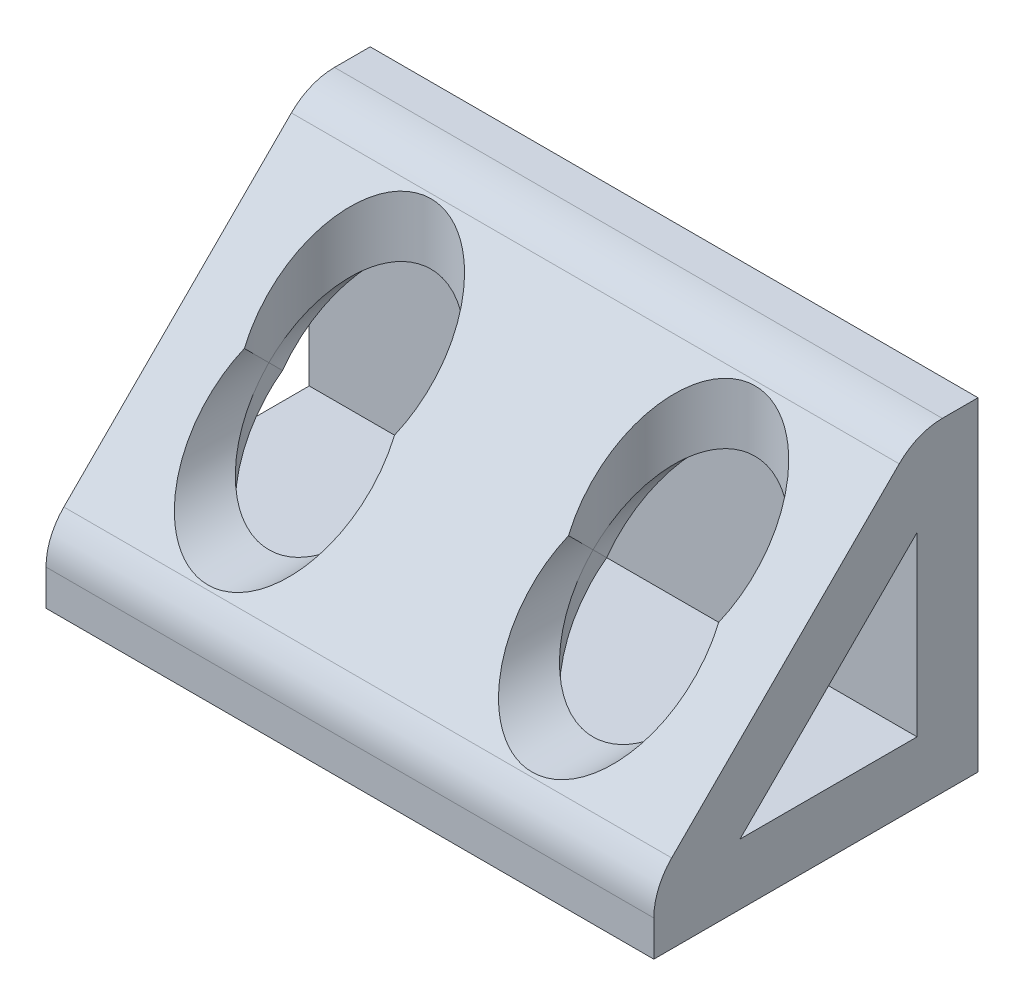
ISO-10303-21;
HEADER;
FILE_DESCRIPTION(('STEP AP214'),'2;1');
FILE_NAME('part.step','',(''),(''),'','','');
FILE_SCHEMA(('AUTOMOTIVE_DESIGN { 1 0 10303 214 1 1 1 1 }'));
ENDSEC;
DATA;
#1=APPLICATION_CONTEXT('core data for automotive mechanical design processes');
#2=APPLICATION_PROTOCOL_DEFINITION('international standard','automotive_design',2000,#1);
#3=PRODUCT_CONTEXT('',#1,'mechanical');
#4=PRODUCT('Part','Part','',(#3));
#5=PRODUCT_RELATED_PRODUCT_CATEGORY('part','',(#4));
#6=PRODUCT_DEFINITION_FORMATION('','',#4);
#7=PRODUCT_DEFINITION_CONTEXT('part definition',#1,'design');
#8=PRODUCT_DEFINITION('design','',#6,#7);
#9=PRODUCT_DEFINITION_SHAPE('','',#8);
#10=(LENGTH_UNIT() NAMED_UNIT(*) SI_UNIT(.MILLI.,.METRE.));
#11=(NAMED_UNIT(*) PLANE_ANGLE_UNIT() SI_UNIT($,.RADIAN.));
#12=(NAMED_UNIT(*) SI_UNIT($,.STERADIAN.) SOLID_ANGLE_UNIT());
#13=UNCERTAINTY_MEASURE_WITH_UNIT(LENGTH_MEASURE(1.E-05),#10,'distance_accuracy_value','');
#14=(GEOMETRIC_REPRESENTATION_CONTEXT(3) GLOBAL_UNCERTAINTY_ASSIGNED_CONTEXT((#13)) GLOBAL_UNIT_ASSIGNED_CONTEXT((#10,
#11,#12)) REPRESENTATION_CONTEXT('',''));
#15=CARTESIAN_POINT('',(0.,0.,0.));
#16=DIRECTION('',(0.,0.,1.));
#17=DIRECTION('',(1.,0.,0.));
#18=AXIS2_PLACEMENT_3D('',#15,#16,#17);
#19=CARTESIAN_POINT('',(-12.7,4.7752,12.7));
#20=DIRECTION('',(0.,-1.,0.));
#21=DIRECTION('',(0.,0.,-1.));
#22=AXIS2_PLACEMENT_3D('',#19,#20,#21);
#23=CYLINDRICAL_SURFACE('',#22,6.35);
#24=CARTESIAN_POINT('',(-12.7,10.722047396956,12.7));
#25=DIRECTION('',(0.,-0.707106781186548,-0.707106781186548));
#26=DIRECTION('',(0.,0.707106781186548,-0.707106781186548));
#27=AXIS2_PLACEMENT_3D('',#24,#25,#26);
#28=ELLIPSE('',#27,8.98025612106916,6.35);
#29=CARTESIAN_POINT('',(-14.9265457635804,4.7752,18.646847396956));
#30=VERTEX_POINT('',#29);
#31=CARTESIAN_POINT('',(-18.9725135213109,11.711023698478,11.711023698478));
#32=VERTEX_POINT('',#31);
#33=EDGE_CURVE('E541',#30,#32,#28,.T.);
#34=ORIENTED_EDGE('',*,*,#33,.T.);
#35=CARTESIAN_POINT('',(-12.7,12.7,12.7));
#36=DIRECTION('',(0.,0.707106781186548,-0.707106781186548));
#37=DIRECTION('',(0.,0.707106781186548,0.707106781186548));
#38=AXIS2_PLACEMENT_3D('',#35,#36,#37);
#39=ELLIPSE('',#38,8.98025612106916,6.35);
#40=CARTESIAN_POINT('',(-19.05,12.7,12.7));
#41=VERTEX_POINT('',#40);
#42=EDGE_CURVE('E543',#32,#41,#39,.T.);
#43=ORIENTED_EDGE('',*,*,#42,.T.);
#44=CARTESIAN_POINT('',(-12.7,12.7,12.7));
#45=DIRECTION('',(0.,0.707106781186548,0.707106781186548));
#46=DIRECTION('',(0.,0.707106781186548,-0.707106781186548));
#47=AXIS2_PLACEMENT_3D('',#44,#45,#46);
#48=ELLIPSE('',#47,8.98025612106916,6.35);
#49=CARTESIAN_POINT('',(-6.35,12.7,12.7));
#50=VERTEX_POINT('',#49);
#51=EDGE_CURVE('E552',#41,#50,#48,.T.);
#52=ORIENTED_EDGE('',*,*,#51,.T.);
#53=CARTESIAN_POINT('',(-12.7,12.7,12.7));
#54=DIRECTION('',(0.,0.707106781186548,-0.707106781186548));
#55=DIRECTION('',(0.,0.707106781186548,0.707106781186548));
#56=AXIS2_PLACEMENT_3D('',#53,#54,#55);
#57=ELLIPSE('',#56,8.98025612106916,6.35);
#58=CARTESIAN_POINT('',(-6.42748647868912,11.711023698478,11.711023698478));
#59=VERTEX_POINT('',#58);
#60=EDGE_CURVE('E833',#50,#59,#57,.T.);
#61=ORIENTED_EDGE('',*,*,#60,.T.);
#62=CARTESIAN_POINT('',(-12.7,10.722047396956,12.7));
#63=DIRECTION('',(0.,-0.707106781186548,-0.707106781186548));
#64=DIRECTION('',(0.,0.707106781186548,-0.707106781186548));
#65=AXIS2_PLACEMENT_3D('',#62,#63,#64);
#66=ELLIPSE('',#65,8.98025612106916,6.35);
#67=CARTESIAN_POINT('',(-10.4734542364196,4.7752,18.646847396956));
#68=VERTEX_POINT('',#67);
#69=EDGE_CURVE('E353',#59,#68,#66,.T.);
#70=ORIENTED_EDGE('',*,*,#69,.T.);
#71=CARTESIAN_POINT('',(-12.7,4.7752,12.7));
#72=DIRECTION('',(0.,1.,0.));
#73=DIRECTION('',(1.,0.,0.));
#74=AXIS2_PLACEMENT_3D('',#71,#72,#73);
#75=CIRCLE('',#74,6.35);
#76=EDGE_CURVE('E343',#30,#68,#75,.T.);
#77=ORIENTED_EDGE('',*,*,#76,.F.);
#78=EDGE_LOOP('',(#34,#43,#52,#61,#70,#77));
#79=FACE_BOUND('',#78,.T.);
#80=ADVANCED_FACE('F41',(#79),#23,.F.);
#81=CARTESIAN_POINT('',(23.8125,24.001376301522,6.173823698478));
#82=DIRECTION('',(0.,-0.707106781186548,-0.707106781186548));
#83=DIRECTION('',(0.,0.707106781186548,-0.707106781186548));
#84=AXIS2_PLACEMENT_3D('',#81,#82,#83);
#85=PLANE('',#84);
#86=CARTESIAN_POINT('',(-12.7,17.4752,12.7));
#87=DIRECTION('',(0.,-0.707106781186548,-0.707106781186548));
#88=DIRECTION('',(0.,0.707106781186548,-0.707106781186548));
#89=AXIS2_PLACEMENT_3D('',#86,#87,#88);
#90=ELLIPSE('',#89,8.98025612106916,6.35);
#91=CARTESIAN_POINT('',(-18.5840348605357,15.0876,15.0876));
#92=VERTEX_POINT('',#91);
#93=CARTESIAN_POINT('',(-6.81596513946425,15.0876,15.0876));
#94=VERTEX_POINT('',#93);
#95=EDGE_CURVE('E326',#92,#94,#90,.T.);
#96=ORIENTED_EDGE('',*,*,#95,.T.);
#97=CARTESIAN_POINT('',(-12.7,12.7,17.4752));
#98=DIRECTION('',(0.,-0.707106781186548,-0.707106781186548));
#99=DIRECTION('',(0.,-0.707106781186548,0.707106781186548));
#100=AXIS2_PLACEMENT_3D('',#97,#98,#99);
#101=ELLIPSE('',#100,8.98025612106916,6.35);
#102=EDGE_CURVE('E869',#94,#92,#101,.T.);
#103=ORIENTED_EDGE('',*,*,#102,.T.);
#104=EDGE_LOOP('',(#96,#103));
#105=FACE_BOUND('',#104,.T.);
#106=CARTESIAN_POINT('',(12.7,12.7,17.4752));
#107=DIRECTION('',(0.,-0.707106781186548,-0.707106781186548));
#108=DIRECTION('',(0.,-0.707106781186548,0.707106781186548));
#109=AXIS2_PLACEMENT_3D('',#106,#107,#108);
#110=ELLIPSE('',#109,8.98025612106916,6.35);
#111=CARTESIAN_POINT('',(18.5840348605357,15.0876,15.0876));
#112=VERTEX_POINT('',#111);
#113=CARTESIAN_POINT('',(6.81596513946425,15.0876,15.0876));
#114=VERTEX_POINT('',#113);
#115=EDGE_CURVE('E874',#112,#114,#110,.T.);
#116=ORIENTED_EDGE('',*,*,#115,.T.);
#117=CARTESIAN_POINT('',(12.7,17.4752,12.7));
#118=DIRECTION('',(0.,-0.707106781186548,-0.707106781186548));
#119=DIRECTION('',(0.,0.707106781186548,-0.707106781186548));
#120=AXIS2_PLACEMENT_3D('',#117,#118,#119);
#121=ELLIPSE('',#120,8.98025612106916,6.35);
#122=EDGE_CURVE('E218',#114,#112,#121,.T.);
#123=ORIENTED_EDGE('',*,*,#122,.T.);
#124=EDGE_LOOP('',(#116,#123));
#125=FACE_BOUND('',#124,.T.);
#126=DIRECTION('',(0.,-0.707106781186548,0.707106781186548));
#127=VECTOR('',#126,1.);
#128=CARTESIAN_POINT('',(23.8125,24.001376301522,6.173823698478));
#129=LINE('',#128,#127);
#130=CARTESIAN_POINT('',(23.8125,24.0013763015224,6.17382369847762));
#131=VERTEX_POINT('',#130);
#132=CARTESIAN_POINT('',(23.8125,6.17382369847761,24.0013763015224));
#133=VERTEX_POINT('',#132);
#134=EDGE_CURVE('E219',#131,#133,#129,.T.);
#135=ORIENTED_EDGE('',*,*,#134,.F.);
#136=DIRECTION('',(-1.,0.,0.));
#137=VECTOR('',#136,1.);
#138=CARTESIAN_POINT('',(23.8125,24.0013763015224,6.17382369847762));
#139=LINE('',#138,#137);
#140=CARTESIAN_POINT('',(-23.8125,24.0013763015224,6.17382369847762));
#141=VERTEX_POINT('',#140);
#142=EDGE_CURVE('E535',#131,#141,#139,.T.);
#143=ORIENTED_EDGE('',*,*,#142,.T.);
#144=DIRECTION('',(0.,-0.707106781186548,0.707106781186548));
#145=VECTOR('',#144,1.);
#146=CARTESIAN_POINT('',(-23.8125,24.001376301522,6.173823698478));
#147=LINE('',#146,#145);
#148=CARTESIAN_POINT('',(-23.8125,6.17382369847761,24.0013763015224));
#149=VERTEX_POINT('',#148);
#150=EDGE_CURVE('E213',#141,#149,#147,.T.);
#151=ORIENTED_EDGE('',*,*,#150,.T.);
#152=DIRECTION('',(-1.,0.,0.));
#153=VECTOR('',#152,1.);
#154=CARTESIAN_POINT('',(23.8125,6.17382369847762,24.0013763015224));
#155=LINE('',#154,#153);
#156=EDGE_CURVE('E537',#149,#133,#155,.F.);
#157=ORIENTED_EDGE('',*,*,#156,.T.);
#158=EDGE_LOOP('',(#135,#143,#151,#157));
#159=FACE_BOUND('',#158,.T.);
#160=ADVANCED_FACE('F534',(#105,#125,#159),#85,.F.);
#161=CARTESIAN_POINT('',(23.8125,2.79724739695653,20.6248000000013));
#162=DIRECTION('',(1.,0.,0.));
#163=DIRECTION('',(0.,0.,-1.));
#164=AXIS2_PLACEMENT_3D('',#161,#162,#163);
#165=PLANE('',#164);
#166=DIRECTION('',(0.,0.,1.));
#167=VECTOR('',#166,1.);
#168=CARTESIAN_POINT('',(23.8125,25.4,0.));
#169=LINE('',#168,#167);
#170=CARTESIAN_POINT('',(23.8125,25.4,0.));
#171=VERTEX_POINT('',#170);
#172=CARTESIAN_POINT('',(23.8125,25.4,2.79724739695653));
#173=VERTEX_POINT('',#172);
#174=EDGE_CURVE('E184',#171,#173,#169,.T.);
#175=ORIENTED_EDGE('',*,*,#174,.T.);
#176=CARTESIAN_POINT('',(23.8125,20.6248000000013,2.79724739695653));
#177=DIRECTION('',(1.,0.,0.));
#178=DIRECTION('',(0.,0.,-1.));
#179=AXIS2_PLACEMENT_3D('',#176,#177,#178);
#180=CIRCLE('',#179,4.7751999999987);
#181=EDGE_CURVE('E49',#173,#131,#180,.T.);
#182=ORIENTED_EDGE('',*,*,#181,.T.);
#183=ORIENTED_EDGE('',*,*,#134,.T.);
#184=CARTESIAN_POINT('',(23.8125,2.79724739695653,20.6248000000013));
#185=DIRECTION('',(1.,0.,0.));
#186=DIRECTION('',(0.,0.,-1.));
#187=AXIS2_PLACEMENT_3D('',#184,#185,#186);
#188=CIRCLE('',#187,4.7751999999987);
#189=CARTESIAN_POINT('',(23.8125,2.79724739695653,25.4));
#190=VERTEX_POINT('',#189);
#191=EDGE_CURVE('E56',#133,#190,#188,.T.);
#192=ORIENTED_EDGE('',*,*,#191,.T.);
#193=DIRECTION('',(0.,1.,0.));
#194=VECTOR('',#193,1.);
#195=CARTESIAN_POINT('',(23.8125,0.,25.4));
#196=LINE('',#195,#194);
#197=CARTESIAN_POINT('',(23.8125,0.,25.4));
#198=VERTEX_POINT('',#197);
#199=EDGE_CURVE('E492',#198,#190,#196,.T.);
#200=ORIENTED_EDGE('',*,*,#199,.F.);
#201=DIRECTION('',(0.,0.,1.));
#202=VECTOR('',#201,1.);
#203=CARTESIAN_POINT('',(23.8125,0.,25.4));
#204=LINE('',#203,#202);
#205=CARTESIAN_POINT('',(23.8125,0.,0.));
#206=VERTEX_POINT('',#205);
#207=EDGE_CURVE('E186',#206,#198,#204,.T.);
#208=ORIENTED_EDGE('',*,*,#207,.F.);
#209=DIRECTION('',(0.,-1.,0.));
#210=VECTOR('',#209,1.);
#211=CARTESIAN_POINT('',(23.8125,0.,0.));
#212=LINE('',#211,#210);
#213=EDGE_CURVE('E180',#171,#206,#212,.T.);
#214=ORIENTED_EDGE('',*,*,#213,.F.);
#215=EDGE_LOOP('',(#175,#182,#183,#192,#200,#208,#214));
#216=FACE_BOUND('',#215,.T.);
#217=DIRECTION('',(0.,-0.707106781186548,0.707106781186548));
#218=VECTOR('',#217,1.);
#219=CARTESIAN_POINT('',(23.8125,18.646847396956,4.7752));
#220=LINE('',#219,#218);
#221=CARTESIAN_POINT('',(23.8125,18.646847396956,4.7752));
#222=VERTEX_POINT('',#221);
#223=CARTESIAN_POINT('',(23.8125,4.7752,18.646847396956));
#224=VERTEX_POINT('',#223);
#225=EDGE_CURVE('E539',#222,#224,#220,.T.);
#226=ORIENTED_EDGE('',*,*,#225,.F.);
#227=DIRECTION('',(0.,-1.,0.));
#228=VECTOR('',#227,1.);
#229=CARTESIAN_POINT('',(23.8125,0.,4.7752));
#230=LINE('',#229,#228);
#231=CARTESIAN_POINT('',(23.8125,4.7752,4.7752));
#232=VERTEX_POINT('',#231);
#233=EDGE_CURVE('E507',#222,#232,#230,.T.);
#234=ORIENTED_EDGE('',*,*,#233,.T.);
#235=DIRECTION('',(0.,0.,1.));
#236=VECTOR('',#235,1.);
#237=CARTESIAN_POINT('',(23.8125,4.7752,25.4));
#238=LINE('',#237,#236);
#239=EDGE_CURVE('E205',#232,#224,#238,.T.);
#240=ORIENTED_EDGE('',*,*,#239,.T.);
#241=EDGE_LOOP('',(#226,#234,#240));
#242=FACE_BOUND('',#241,.T.);
#243=ADVANCED_FACE('F182',(#216,#242),#165,.T.);
#244=CARTESIAN_POINT('',(12.7,12.7,4.7752));
#245=DIRECTION('',(0.,0.,-1.));
#246=DIRECTION('',(0.,-1.,0.));
#247=AXIS2_PLACEMENT_3D('',#244,#245,#246);
#248=CYLINDRICAL_SURFACE('',#247,6.35);
#249=CARTESIAN_POINT('',(12.7,12.7,10.722047396956));
#250=DIRECTION('',(0.,-0.707106781186548,-0.707106781186548));
#251=DIRECTION('',(0.,-0.707106781186548,0.707106781186548));
#252=AXIS2_PLACEMENT_3D('',#249,#250,#251);
#253=ELLIPSE('',#252,8.98025612106916,6.35);
#254=CARTESIAN_POINT('',(14.9265457635804,18.646847396956,4.7752));
#255=VERTEX_POINT('',#254);
#256=CARTESIAN_POINT('',(18.9725135213109,11.711023698478,11.711023698478));
#257=VERTEX_POINT('',#256);
#258=EDGE_CURVE('E380',#255,#257,#253,.T.);
#259=ORIENTED_EDGE('',*,*,#258,.T.);
#260=CARTESIAN_POINT('',(12.7,12.7,12.7));
#261=DIRECTION('',(0.,-0.707106781186548,0.707106781186548));
#262=DIRECTION('',(0.,0.707106781186548,0.707106781186548));
#263=AXIS2_PLACEMENT_3D('',#260,#261,#262);
#264=ELLIPSE('',#263,8.98025612106916,6.35);
#265=CARTESIAN_POINT('',(19.05,12.7,12.7));
#266=VERTEX_POINT('',#265);
#267=EDGE_CURVE('E392',#257,#266,#264,.T.);
#268=ORIENTED_EDGE('',*,*,#267,.T.);
#269=CARTESIAN_POINT('',(12.7,12.7,12.7));
#270=DIRECTION('',(0.,0.707106781186548,0.707106781186548));
#271=DIRECTION('',(0.,-0.707106781186548,0.707106781186548));
#272=AXIS2_PLACEMENT_3D('',#269,#270,#271);
#273=ELLIPSE('',#272,8.98025612106916,6.35);
#274=CARTESIAN_POINT('',(6.35,12.7,12.7));
#275=VERTEX_POINT('',#274);
#276=EDGE_CURVE('E395',#266,#275,#273,.T.);
#277=ORIENTED_EDGE('',*,*,#276,.T.);
#278=CARTESIAN_POINT('',(12.7,12.7,12.7));
#279=DIRECTION('',(0.,-0.707106781186548,0.707106781186548));
#280=DIRECTION('',(0.,0.707106781186548,0.707106781186548));
#281=AXIS2_PLACEMENT_3D('',#278,#279,#280);
#282=ELLIPSE('',#281,8.98025612106916,6.35);
#283=CARTESIAN_POINT('',(6.42748647868912,11.711023698478,11.711023698478));
#284=VERTEX_POINT('',#283);
#285=EDGE_CURVE('E920',#275,#284,#282,.T.);
#286=ORIENTED_EDGE('',*,*,#285,.T.);
#287=CARTESIAN_POINT('',(12.7,12.7,10.722047396956));
#288=DIRECTION('',(0.,-0.707106781186548,-0.707106781186548));
#289=DIRECTION('',(0.,-0.707106781186548,0.707106781186548));
#290=AXIS2_PLACEMENT_3D('',#287,#288,#289);
#291=ELLIPSE('',#290,8.98025612106916,6.35);
#292=CARTESIAN_POINT('',(10.4734542364196,18.646847396956,4.7752));
#293=VERTEX_POINT('',#292);
#294=EDGE_CURVE('E925',#284,#293,#291,.T.);
#295=ORIENTED_EDGE('',*,*,#294,.T.);
#296=CARTESIAN_POINT('',(12.7,12.7,4.7752));
#297=DIRECTION('',(0.,0.,1.));
#298=DIRECTION('',(1.,0.,0.));
#299=AXIS2_PLACEMENT_3D('',#296,#297,#298);
#300=CIRCLE('',#299,6.35);
#301=EDGE_CURVE('E382',#255,#293,#300,.T.);
#302=ORIENTED_EDGE('',*,*,#301,.F.);
#303=EDGE_LOOP('',(#259,#268,#277,#286,#295,#302));
#304=FACE_BOUND('',#303,.T.);
#305=ADVANCED_FACE('F586',(#304),#248,.F.);
#306=CARTESIAN_POINT('',(23.8125,18.646847396956,4.7752));
#307=DIRECTION('',(0.,-0.707106781186548,-0.707106781186548));
#308=DIRECTION('',(0.,0.707106781186548,-0.707106781186548));
#309=AXIS2_PLACEMENT_3D('',#306,#307,#308);
#310=PLANE('',#309);
#311=CARTESIAN_POINT('',(-12.7,12.7,10.722047396956));
#312=DIRECTION('',(0.,-0.707106781186548,-0.707106781186548));
#313=DIRECTION('',(0.,-0.707106781186548,0.707106781186548));
#314=AXIS2_PLACEMENT_3D('',#311,#312,#313);
#315=ELLIPSE('',#314,8.98025612106916,6.35);
#316=CARTESIAN_POINT('',(-10.4734542364196,18.646847396956,4.7752));
#317=VERTEX_POINT('',#316);
#318=EDGE_CURVE('E932',#317,#59,#315,.T.);
#319=ORIENTED_EDGE('',*,*,#318,.F.);
#320=DIRECTION('',(-1.,0.,0.));
#321=VECTOR('',#320,1.);
#322=CARTESIAN_POINT('',(23.8125,18.646847396956,4.7752));
#323=LINE('',#322,#321);
#324=EDGE_CURVE('E472',#293,#317,#323,.T.);
#325=ORIENTED_EDGE('',*,*,#324,.F.);
#326=ORIENTED_EDGE('',*,*,#294,.F.);
#327=CARTESIAN_POINT('',(12.7,10.722047396956,12.7));
#328=DIRECTION('',(0.,-0.707106781186548,-0.707106781186548));
#329=DIRECTION('',(0.,0.707106781186548,-0.707106781186548));
#330=AXIS2_PLACEMENT_3D('',#327,#328,#329);
#331=ELLIPSE('',#330,8.98025612106916,6.35);
#332=CARTESIAN_POINT('',(10.4734542364196,4.7752,18.646847396956));
#333=VERTEX_POINT('',#332);
#334=EDGE_CURVE('E939',#333,#284,#331,.T.);
#335=ORIENTED_EDGE('',*,*,#334,.F.);
#336=DIRECTION('',(-1.,0.,0.));
#337=VECTOR('',#336,1.);
#338=CARTESIAN_POINT('',(23.8125,4.7752,18.646847396956));
#339=LINE('',#338,#337);
#340=EDGE_CURVE('E429',#333,#68,#339,.T.);
#341=ORIENTED_EDGE('',*,*,#340,.T.);
#342=ORIENTED_EDGE('',*,*,#69,.F.);
#343=EDGE_LOOP('',(#319,#325,#326,#335,#341,#342));
#344=FACE_BOUND('',#343,.T.);
#345=ADVANCED_FACE('F589',(#344),#310,.T.);
#346=CARTESIAN_POINT('',(12.7,4.7752,12.7));
#347=DIRECTION('',(0.,-1.,0.));
#348=DIRECTION('',(0.,0.,-1.));
#349=AXIS2_PLACEMENT_3D('',#346,#347,#348);
#350=CYLINDRICAL_SURFACE('',#349,6.35);
#351=CARTESIAN_POINT('',(12.7,12.7,12.7));
#352=DIRECTION('',(0.,0.707106781186548,0.707106781186548));
#353=DIRECTION('',(0.,-0.707106781186548,0.707106781186548));
#354=AXIS2_PLACEMENT_3D('',#351,#352,#353);
#355=ELLIPSE('',#354,8.98025612106916,6.35);
#356=EDGE_CURVE('E415',#275,#266,#355,.T.);
#357=ORIENTED_EDGE('',*,*,#356,.T.);
#358=ORIENTED_EDGE('',*,*,#267,.F.);
#359=CARTESIAN_POINT('',(12.7,10.722047396956,12.7));
#360=DIRECTION('',(0.,-0.707106781186548,-0.707106781186548));
#361=DIRECTION('',(0.,0.707106781186548,-0.707106781186548));
#362=AXIS2_PLACEMENT_3D('',#359,#360,#361);
#363=ELLIPSE('',#362,8.98025612106916,6.35);
#364=CARTESIAN_POINT('',(14.9265457635804,4.7752,18.646847396956));
#365=VERTEX_POINT('',#364);
#366=EDGE_CURVE('E413',#257,#365,#363,.T.);
#367=ORIENTED_EDGE('',*,*,#366,.T.);
#368=CARTESIAN_POINT('',(12.7,4.7752,12.7));
#369=DIRECTION('',(0.,1.,0.));
#370=DIRECTION('',(1.,0.,0.));
#371=AXIS2_PLACEMENT_3D('',#368,#369,#370);
#372=CIRCLE('',#371,6.35);
#373=EDGE_CURVE('E428',#333,#365,#372,.T.);
#374=ORIENTED_EDGE('',*,*,#373,.F.);
#375=ORIENTED_EDGE('',*,*,#334,.T.);
#376=ORIENTED_EDGE('',*,*,#285,.F.);
#377=EDGE_LOOP('',(#357,#358,#367,#374,#375,#376));
#378=FACE_BOUND('',#377,.T.);
#379=ADVANCED_FACE('F593',(#378),#350,.F.);
#380=CARTESIAN_POINT('',(23.8125,18.646847396956,4.7752));
#381=DIRECTION('',(0.,-0.707106781186548,-0.707106781186548));
#382=DIRECTION('',(0.,0.707106781186548,-0.707106781186548));
#383=AXIS2_PLACEMENT_3D('',#380,#381,#382);
#384=PLANE('',#383);
#385=ORIENTED_EDGE('',*,*,#366,.F.);
#386=ORIENTED_EDGE('',*,*,#258,.F.);
#387=DIRECTION('',(-1.,0.,0.));
#388=VECTOR('',#387,1.);
#389=CARTESIAN_POINT('',(23.8125,18.646847396956,4.7752));
#390=LINE('',#389,#388);
#391=EDGE_CURVE('E296',#222,#255,#390,.T.);
#392=ORIENTED_EDGE('',*,*,#391,.F.);
#393=ORIENTED_EDGE('',*,*,#225,.T.);
#394=DIRECTION('',(-1.,0.,0.));
#395=VECTOR('',#394,1.);
#396=CARTESIAN_POINT('',(23.8125,4.7752,18.646847396956));
#397=LINE('',#396,#395);
#398=EDGE_CURVE('E327',#224,#365,#397,.T.);
#399=ORIENTED_EDGE('',*,*,#398,.T.);
#400=EDGE_LOOP('',(#385,#386,#392,#393,#399));
#401=FACE_BOUND('',#400,.T.);
#402=ADVANCED_FACE('F597',(#401),#384,.T.);
#403=CARTESIAN_POINT('',(12.7,12.7,4.7752));
#404=DIRECTION('',(0.,0.,-1.));
#405=DIRECTION('',(0.,1.,0.));
#406=AXIS2_PLACEMENT_3D('',#403,#404,#405);
#407=CYLINDRICAL_SURFACE('',#406,6.35);
#408=ORIENTED_EDGE('',*,*,#115,.F.);
#409=CARTESIAN_POINT('',(12.7,12.7,12.7));
#410=DIRECTION('',(0.,-0.707106781186548,0.707106781186548));
#411=DIRECTION('',(0.,0.707106781186548,0.707106781186548));
#412=AXIS2_PLACEMENT_3D('',#409,#410,#411);
#413=ELLIPSE('',#412,8.98025612106916,6.35);
#414=EDGE_CURVE('E957',#266,#112,#413,.T.);
#415=ORIENTED_EDGE('',*,*,#414,.F.);
#416=ORIENTED_EDGE('',*,*,#356,.F.);
#417=CARTESIAN_POINT('',(12.7,12.7,12.7));
#418=DIRECTION('',(0.,-0.707106781186548,0.707106781186548));
#419=DIRECTION('',(0.,0.707106781186548,0.707106781186548));
#420=AXIS2_PLACEMENT_3D('',#417,#418,#419);
#421=ELLIPSE('',#420,8.98025612106916,6.35);
#422=EDGE_CURVE('E963',#114,#275,#421,.T.);
#423=ORIENTED_EDGE('',*,*,#422,.F.);
#424=EDGE_LOOP('',(#408,#415,#416,#423));
#425=FACE_BOUND('',#424,.T.);
#426=ADVANCED_FACE('F601',(#425),#407,.F.);
#427=CARTESIAN_POINT('',(12.7,4.7752,12.7));
#428=DIRECTION('',(0.,-1.,0.));
#429=DIRECTION('',(0.,0.,1.));
#430=AXIS2_PLACEMENT_3D('',#427,#428,#429);
#431=CYLINDRICAL_SURFACE('',#430,6.35);
#432=ORIENTED_EDGE('',*,*,#276,.F.);
#433=ORIENTED_EDGE('',*,*,#414,.T.);
#434=ORIENTED_EDGE('',*,*,#122,.F.);
#435=ORIENTED_EDGE('',*,*,#422,.T.);
#436=EDGE_LOOP('',(#432,#433,#434,#435));
#437=FACE_BOUND('',#436,.T.);
#438=ADVANCED_FACE('F605',(#437),#431,.F.);
#439=CARTESIAN_POINT('',(-12.7,12.7,4.7752));
#440=DIRECTION('',(0.,0.,-1.));
#441=DIRECTION('',(0.,-1.,0.));
#442=AXIS2_PLACEMENT_3D('',#439,#440,#441);
#443=CYLINDRICAL_SURFACE('',#442,6.35);
#444=CARTESIAN_POINT('',(-12.7,12.7,12.7));
#445=DIRECTION('',(0.,0.707106781186548,0.707106781186548));
#446=DIRECTION('',(0.,0.707106781186548,-0.707106781186548));
#447=AXIS2_PLACEMENT_3D('',#444,#445,#446);
#448=ELLIPSE('',#447,8.98025612106916,6.35);
#449=EDGE_CURVE('E455',#50,#41,#448,.T.);
#450=ORIENTED_EDGE('',*,*,#449,.T.);
#451=ORIENTED_EDGE('',*,*,#42,.F.);
#452=CARTESIAN_POINT('',(-12.7,12.7,10.722047396956));
#453=DIRECTION('',(0.,-0.707106781186548,-0.707106781186548));
#454=DIRECTION('',(0.,-0.707106781186548,0.707106781186548));
#455=AXIS2_PLACEMENT_3D('',#452,#453,#454);
#456=ELLIPSE('',#455,8.98025612106916,6.35);
#457=CARTESIAN_POINT('',(-14.9265457635804,18.646847396956,4.7752));
#458=VERTEX_POINT('',#457);
#459=EDGE_CURVE('E450',#32,#458,#456,.T.);
#460=ORIENTED_EDGE('',*,*,#459,.T.);
#461=CARTESIAN_POINT('',(-12.7,12.7,4.7752));
#462=DIRECTION('',(0.,0.,1.));
#463=DIRECTION('',(1.,0.,0.));
#464=AXIS2_PLACEMENT_3D('',#461,#462,#463);
#465=CIRCLE('',#464,6.35);
#466=EDGE_CURVE('E303',#317,#458,#465,.T.);
#467=ORIENTED_EDGE('',*,*,#466,.F.);
#468=ORIENTED_EDGE('',*,*,#318,.T.);
#469=ORIENTED_EDGE('',*,*,#60,.F.);
#470=EDGE_LOOP('',(#450,#451,#460,#467,#468,#469));
#471=FACE_BOUND('',#470,.T.);
#472=ADVANCED_FACE('F609',(#471),#443,.F.);
#473=CARTESIAN_POINT('',(23.8125,18.646847396956,4.7752));
#474=DIRECTION('',(0.,-0.707106781186548,-0.707106781186548));
#475=DIRECTION('',(0.,0.707106781186548,-0.707106781186548));
#476=AXIS2_PLACEMENT_3D('',#473,#474,#475);
#477=PLANE('',#476);
#478=ORIENTED_EDGE('',*,*,#459,.F.);
#479=ORIENTED_EDGE('',*,*,#33,.F.);
#480=DIRECTION('',(-1.,0.,0.));
#481=VECTOR('',#480,1.);
#482=CARTESIAN_POINT('',(23.8125,4.7752,18.646847396956));
#483=LINE('',#482,#481);
#484=CARTESIAN_POINT('',(-23.8125,4.7752,18.646847396956));
#485=VERTEX_POINT('',#484);
#486=EDGE_CURVE('E341',#30,#485,#483,.T.);
#487=ORIENTED_EDGE('',*,*,#486,.T.);
#488=DIRECTION('',(0.,-0.707106781186548,0.707106781186548));
#489=VECTOR('',#488,1.);
#490=CARTESIAN_POINT('',(-23.8125,18.646847396956,4.7752));
#491=LINE('',#490,#489);
#492=CARTESIAN_POINT('',(-23.8125,18.646847396956,4.7752));
#493=VERTEX_POINT('',#492);
#494=EDGE_CURVE('E448',#493,#485,#491,.T.);
#495=ORIENTED_EDGE('',*,*,#494,.F.);
#496=DIRECTION('',(-1.,0.,0.));
#497=VECTOR('',#496,1.);
#498=CARTESIAN_POINT('',(23.8125,18.646847396956,4.7752));
#499=LINE('',#498,#497);
#500=EDGE_CURVE('E298',#458,#493,#499,.T.);
#501=ORIENTED_EDGE('',*,*,#500,.F.);
#502=EDGE_LOOP('',(#478,#479,#487,#495,#501));
#503=FACE_BOUND('',#502,.T.);
#504=ADVANCED_FACE('F613',(#503),#477,.T.);
#505=CARTESIAN_POINT('',(-23.8125,2.79724739695653,20.6248000000013));
#506=DIRECTION('',(1.,0.,0.));
#507=DIRECTION('',(0.,0.,-1.));
#508=AXIS2_PLACEMENT_3D('',#505,#506,#507);
#509=PLANE('',#508);
#510=DIRECTION('',(0.,1.,0.));
#511=VECTOR('',#510,1.);
#512=CARTESIAN_POINT('',(-23.8125,25.4,4.7752));
#513=LINE('',#512,#511);
#514=CARTESIAN_POINT('',(-23.8125,4.7752,4.7752));
#515=VERTEX_POINT('',#514);
#516=EDGE_CURVE('E198',#515,#493,#513,.T.);
#517=ORIENTED_EDGE('',*,*,#516,.T.);
#518=ORIENTED_EDGE('',*,*,#494,.T.);
#519=DIRECTION('',(0.,0.,-1.));
#520=VECTOR('',#519,1.);
#521=CARTESIAN_POINT('',(-23.8125,4.7752,4.7752));
#522=LINE('',#521,#520);
#523=EDGE_CURVE('E496',#485,#515,#522,.T.);
#524=ORIENTED_EDGE('',*,*,#523,.T.);
#525=EDGE_LOOP('',(#517,#518,#524));
#526=FACE_BOUND('',#525,.T.);
#527=ORIENTED_EDGE('',*,*,#150,.F.);
#528=CARTESIAN_POINT('',(-23.8125,20.6248000000013,2.79724739695653));
#529=DIRECTION('',(1.,0.,0.));
#530=DIRECTION('',(0.,0.,-1.));
#531=AXIS2_PLACEMENT_3D('',#528,#529,#530);
#532=CIRCLE('',#531,4.7751999999987);
#533=CARTESIAN_POINT('',(-23.8125,25.4,2.79724739695653));
#534=VERTEX_POINT('',#533);
#535=EDGE_CURVE('E522',#141,#534,#532,.F.);
#536=ORIENTED_EDGE('',*,*,#535,.T.);
#537=DIRECTION('',(0.,0.,1.));
#538=VECTOR('',#537,1.);
#539=CARTESIAN_POINT('',(-23.8125,25.4,0.));
#540=LINE('',#539,#538);
#541=CARTESIAN_POINT('',(-23.8125,25.4,0.));
#542=VERTEX_POINT('',#541);
#543=EDGE_CURVE('E202',#542,#534,#540,.T.);
#544=ORIENTED_EDGE('',*,*,#543,.F.);
#545=DIRECTION('',(0.,1.,0.));
#546=VECTOR('',#545,1.);
#547=CARTESIAN_POINT('',(-23.8125,25.4,0.));
#548=LINE('',#547,#546);
#549=CARTESIAN_POINT('',(-23.8125,0.,0.));
#550=VERTEX_POINT('',#549);
#551=EDGE_CURVE('E196',#550,#542,#548,.T.);
#552=ORIENTED_EDGE('',*,*,#551,.F.);
#553=DIRECTION('',(0.,0.,-1.));
#554=VECTOR('',#553,1.);
#555=CARTESIAN_POINT('',(-23.8125,0.,4.7752));
#556=LINE('',#555,#554);
#557=CARTESIAN_POINT('',(-23.8125,0.,25.4));
#558=VERTEX_POINT('',#557);
#559=EDGE_CURVE('E501',#558,#550,#556,.T.);
#560=ORIENTED_EDGE('',*,*,#559,.F.);
#561=DIRECTION('',(0.,1.,0.));
#562=VECTOR('',#561,1.);
#563=CARTESIAN_POINT('',(-23.8125,0.,25.4));
#564=LINE('',#563,#562);
#565=CARTESIAN_POINT('',(-23.8125,2.79724739695653,25.4));
#566=VERTEX_POINT('',#565);
#567=EDGE_CURVE('E503',#558,#566,#564,.T.);
#568=ORIENTED_EDGE('',*,*,#567,.T.);
#569=CARTESIAN_POINT('',(-23.8125,2.79724739695653,20.6248000000013));
#570=DIRECTION('',(1.,0.,0.));
#571=DIRECTION('',(0.,0.,-1.));
#572=AXIS2_PLACEMENT_3D('',#569,#570,#571);
#573=CIRCLE('',#572,4.7751999999987);
#574=EDGE_CURVE('E529',#566,#149,#573,.F.);
#575=ORIENTED_EDGE('',*,*,#574,.T.);
#576=EDGE_LOOP('',(#527,#536,#544,#552,#560,#568,#575));
#577=FACE_BOUND('',#576,.T.);
#578=ADVANCED_FACE('F520',(#526,#577),#509,.F.);
#579=CARTESIAN_POINT('',(-12.7,4.7752,12.7));
#580=DIRECTION('',(0.,-1.,0.));
#581=DIRECTION('',(0.,0.,1.));
#582=AXIS2_PLACEMENT_3D('',#579,#580,#581);
#583=CYLINDRICAL_SURFACE('',#582,6.35);
#584=ORIENTED_EDGE('',*,*,#95,.F.);
#585=CARTESIAN_POINT('',(-12.7,12.7,12.7));
#586=DIRECTION('',(0.,0.707106781186548,-0.707106781186548));
#587=DIRECTION('',(0.,0.707106781186548,0.707106781186548));
#588=AXIS2_PLACEMENT_3D('',#585,#586,#587);
#589=ELLIPSE('',#588,8.98025612106916,6.35);
#590=EDGE_CURVE('E481',#41,#92,#589,.T.);
#591=ORIENTED_EDGE('',*,*,#590,.F.);
#592=ORIENTED_EDGE('',*,*,#449,.F.);
#593=CARTESIAN_POINT('',(-12.7,12.7,12.7));
#594=DIRECTION('',(0.,0.707106781186548,-0.707106781186548));
#595=DIRECTION('',(0.,0.707106781186548,0.707106781186548));
#596=AXIS2_PLACEMENT_3D('',#593,#594,#595);
#597=ELLIPSE('',#596,8.98025612106916,6.35);
#598=EDGE_CURVE('E485',#94,#50,#597,.T.);
#599=ORIENTED_EDGE('',*,*,#598,.F.);
#600=EDGE_LOOP('',(#584,#591,#592,#599));
#601=FACE_BOUND('',#600,.T.);
#602=ADVANCED_FACE('F620',(#601),#583,.F.);
#603=CARTESIAN_POINT('',(-12.7,12.7,4.7752));
#604=DIRECTION('',(0.,0.,-1.));
#605=DIRECTION('',(0.,1.,0.));
#606=AXIS2_PLACEMENT_3D('',#603,#604,#605);
#607=CYLINDRICAL_SURFACE('',#606,6.35);
#608=ORIENTED_EDGE('',*,*,#51,.F.);
#609=ORIENTED_EDGE('',*,*,#590,.T.);
#610=ORIENTED_EDGE('',*,*,#102,.F.);
#611=ORIENTED_EDGE('',*,*,#598,.T.);
#612=EDGE_LOOP('',(#608,#609,#610,#611));
#613=FACE_BOUND('',#612,.T.);
#614=ADVANCED_FACE('F624',(#613),#607,.F.);
#615=CARTESIAN_POINT('',(-23.8125,0.,25.4));
#616=DIRECTION('',(0.,0.,-1.));
#617=DIRECTION('',(-1.,0.,0.));
#618=AXIS2_PLACEMENT_3D('',#615,#616,#617);
#619=PLANE('',#618);
#620=ORIENTED_EDGE('',*,*,#199,.T.);
#621=DIRECTION('',(-1.,0.,0.));
#622=VECTOR('',#621,1.);
#623=CARTESIAN_POINT('',(-23.8125,2.79724739695653,25.4));
#624=LINE('',#623,#622);
#625=EDGE_CURVE('E12',#190,#566,#624,.T.);
#626=ORIENTED_EDGE('',*,*,#625,.T.);
#627=ORIENTED_EDGE('',*,*,#567,.F.);
#628=DIRECTION('',(-1.,0.,0.));
#629=VECTOR('',#628,1.);
#630=CARTESIAN_POINT('',(-23.8125,0.,25.4));
#631=LINE('',#630,#629);
#632=EDGE_CURVE('E504',#198,#558,#631,.T.);
#633=ORIENTED_EDGE('',*,*,#632,.F.);
#634=EDGE_LOOP('',(#620,#626,#627,#633));
#635=FACE_BOUND('',#634,.T.);
#636=ADVANCED_FACE('F568',(#635),#619,.F.);
#637=CARTESIAN_POINT('',(0.,0.,0.));
#638=DIRECTION('',(0.,1.,0.));
#639=DIRECTION('',(0.,0.,1.));
#640=AXIS2_PLACEMENT_3D('',#637,#638,#639);
#641=PLANE('',#640);
#642=ORIENTED_EDGE('',*,*,#559,.T.);
#643=DIRECTION('',(-1.,0.,0.));
#644=VECTOR('',#643,1.);
#645=CARTESIAN_POINT('',(-23.8125,0.,0.));
#646=LINE('',#645,#644);
#647=EDGE_CURVE('E190',#206,#550,#646,.T.);
#648=ORIENTED_EDGE('',*,*,#647,.F.);
#649=ORIENTED_EDGE('',*,*,#207,.T.);
#650=ORIENTED_EDGE('',*,*,#632,.T.);
#651=EDGE_LOOP('',(#642,#648,#649,#650));
#652=FACE_BOUND('',#651,.T.);
#653=ADVANCED_FACE('F631',(#652),#641,.F.);
#654=CARTESIAN_POINT('',(0.,4.7752,0.));
#655=DIRECTION('',(0.,1.,0.));
#656=DIRECTION('',(0.,0.,1.));
#657=AXIS2_PLACEMENT_3D('',#654,#655,#656);
#658=PLANE('',#657);
#659=ORIENTED_EDGE('',*,*,#398,.F.);
#660=ORIENTED_EDGE('',*,*,#239,.F.);
#661=DIRECTION('',(1.,0.,0.));
#662=VECTOR('',#661,1.);
#663=CARTESIAN_POINT('',(23.8125,4.7752,4.7752));
#664=LINE('',#663,#662);
#665=EDGE_CURVE('E201',#515,#232,#664,.T.);
#666=ORIENTED_EDGE('',*,*,#665,.F.);
#667=ORIENTED_EDGE('',*,*,#523,.F.);
#668=ORIENTED_EDGE('',*,*,#486,.F.);
#669=ORIENTED_EDGE('',*,*,#76,.T.);
#670=ORIENTED_EDGE('',*,*,#340,.F.);
#671=ORIENTED_EDGE('',*,*,#373,.T.);
#672=EDGE_LOOP('',(#659,#660,#666,#667,#668,#669,#670,#671));
#673=FACE_BOUND('',#672,.T.);
#674=ADVANCED_FACE('F632',(#673),#658,.T.);
#675=CARTESIAN_POINT('',(23.8125,25.4,0.));
#676=DIRECTION('',(0.,-1.,0.));
#677=DIRECTION('',(0.,0.,-1.));
#678=AXIS2_PLACEMENT_3D('',#675,#676,#677);
#679=PLANE('',#678);
#680=ORIENTED_EDGE('',*,*,#543,.T.);
#681=DIRECTION('',(-1.,0.,0.));
#682=VECTOR('',#681,1.);
#683=CARTESIAN_POINT('',(23.8125,25.4,2.79724739695653));
#684=LINE('',#683,#682);
#685=EDGE_CURVE('E64',#534,#173,#684,.F.);
#686=ORIENTED_EDGE('',*,*,#685,.T.);
#687=ORIENTED_EDGE('',*,*,#174,.F.);
#688=DIRECTION('',(1.,0.,0.));
#689=VECTOR('',#688,1.);
#690=CARTESIAN_POINT('',(23.8125,25.4,0.));
#691=LINE('',#690,#689);
#692=EDGE_CURVE('E191',#542,#171,#691,.T.);
#693=ORIENTED_EDGE('',*,*,#692,.F.);
#694=EDGE_LOOP('',(#680,#686,#687,#693));
#695=FACE_BOUND('',#694,.T.);
#696=ADVANCED_FACE('F200',(#695),#679,.F.);
#697=CARTESIAN_POINT('',(0.,0.,0.));
#698=DIRECTION('',(0.,0.,1.));
#699=DIRECTION('',(1.,0.,0.));
#700=AXIS2_PLACEMENT_3D('',#697,#698,#699);
#701=PLANE('',#700);
#702=ORIENTED_EDGE('',*,*,#692,.T.);
#703=ORIENTED_EDGE('',*,*,#213,.T.);
#704=ORIENTED_EDGE('',*,*,#647,.T.);
#705=ORIENTED_EDGE('',*,*,#551,.T.);
#706=EDGE_LOOP('',(#702,#703,#704,#705));
#707=FACE_BOUND('',#706,.T.);
#708=ADVANCED_FACE('F194',(#707),#701,.F.);
#709=CARTESIAN_POINT('',(0.,0.,4.7752));
#710=DIRECTION('',(0.,0.,1.));
#711=DIRECTION('',(1.,0.,0.));
#712=AXIS2_PLACEMENT_3D('',#709,#710,#711);
#713=PLANE('',#712);
#714=ORIENTED_EDGE('',*,*,#233,.F.);
#715=ORIENTED_EDGE('',*,*,#391,.T.);
#716=ORIENTED_EDGE('',*,*,#301,.T.);
#717=ORIENTED_EDGE('',*,*,#324,.T.);
#718=ORIENTED_EDGE('',*,*,#466,.T.);
#719=ORIENTED_EDGE('',*,*,#500,.T.);
#720=ORIENTED_EDGE('',*,*,#516,.F.);
#721=ORIENTED_EDGE('',*,*,#665,.T.);
#722=EDGE_LOOP('',(#714,#715,#716,#717,#718,#719,#720,#721));
#723=FACE_BOUND('',#722,.T.);
#724=ADVANCED_FACE('F575',(#723),#713,.T.);
#725=CARTESIAN_POINT('',(23.8125,20.6248000000013,2.79724739695653));
#726=DIRECTION('',(-1.,0.,0.));
#727=DIRECTION('',(0.,0.,1.));
#728=AXIS2_PLACEMENT_3D('',#725,#726,#727);
#729=CYLINDRICAL_SURFACE('',#728,4.7751999999987);
#730=ORIENTED_EDGE('',*,*,#181,.F.);
#731=ORIENTED_EDGE('',*,*,#685,.F.);
#732=ORIENTED_EDGE('',*,*,#535,.F.);
#733=ORIENTED_EDGE('',*,*,#142,.F.);
#734=EDGE_LOOP('',(#730,#731,#732,#733));
#735=FACE_BOUND('',#734,.T.);
#736=ADVANCED_FACE('F524',(#735),#729,.T.);
#737=CARTESIAN_POINT('',(-23.8125,2.79724739695653,20.6248000000013));
#738=DIRECTION('',(-1.,0.,0.));
#739=DIRECTION('',(0.,0.,1.));
#740=AXIS2_PLACEMENT_3D('',#737,#738,#739);
#741=CYLINDRICAL_SURFACE('',#740,4.7751999999987);
#742=ORIENTED_EDGE('',*,*,#191,.F.);
#743=ORIENTED_EDGE('',*,*,#156,.F.);
#744=ORIENTED_EDGE('',*,*,#574,.F.);
#745=ORIENTED_EDGE('',*,*,#625,.F.);
#746=EDGE_LOOP('',(#742,#743,#744,#745));
#747=FACE_BOUND('',#746,.T.);
#748=ADVANCED_FACE('F43',(#747),#741,.T.);
#749=CLOSED_SHELL('',(#80,#160,#243,#305,#345,#379,#402,#426,#438,#472,#504,#578,#602,#614,#636,
#653,#674,#696,#708,#724,#736,#748));
#750=MANIFOLD_SOLID_BREP('B2',#749);
#751=ADVANCED_BREP_SHAPE_REPRESENTATION('',(#18,#750),#14);
#752=SHAPE_DEFINITION_REPRESENTATION(#9,#751);
ENDSEC;
END-ISO-10303-21;
